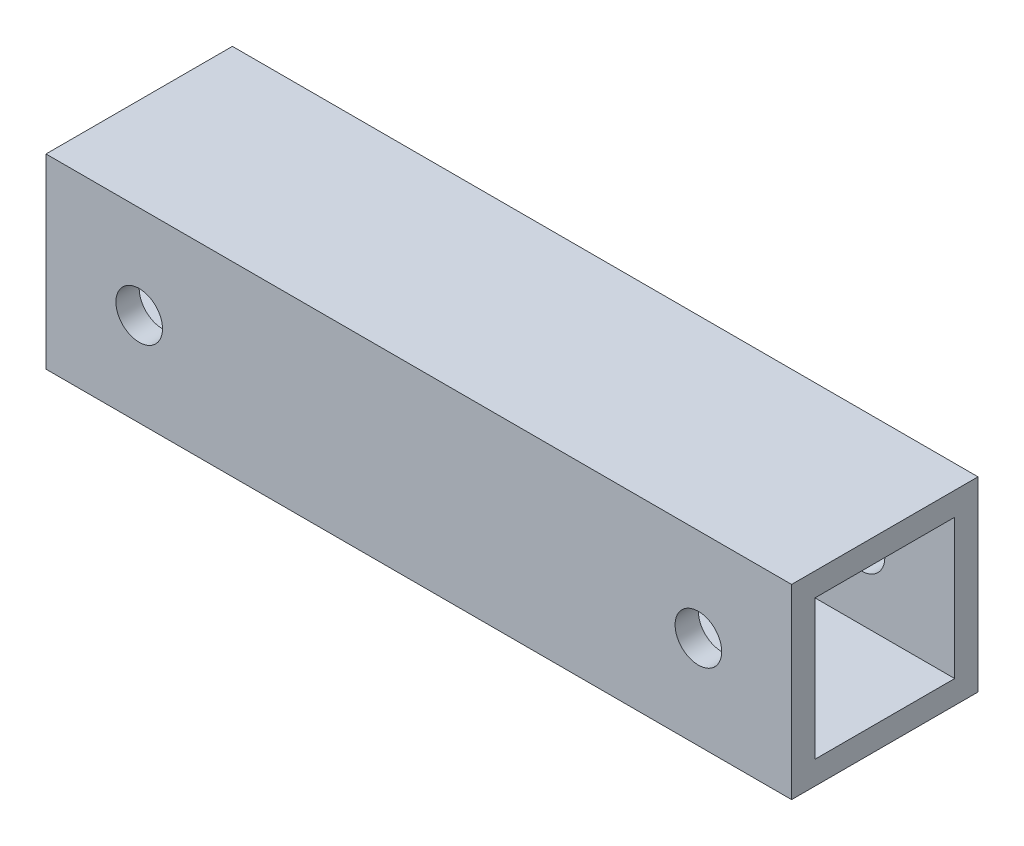
ISO-10303-21;
HEADER;
FILE_DESCRIPTION(('STEP AP214'),'2;1');
FILE_NAME('part.step','',(''),(''),'','','');
FILE_SCHEMA(('AUTOMOTIVE_DESIGN { 1 0 10303 214 1 1 1 1 }'));
ENDSEC;
DATA;
#1=APPLICATION_CONTEXT('core data for automotive mechanical design processes');
#2=APPLICATION_PROTOCOL_DEFINITION('international standard','automotive_design',2000,#1);
#3=PRODUCT_CONTEXT('',#1,'mechanical');
#4=PRODUCT('Part','Part','',(#3));
#5=PRODUCT_RELATED_PRODUCT_CATEGORY('part','',(#4));
#6=PRODUCT_DEFINITION_FORMATION('','',#4);
#7=PRODUCT_DEFINITION_CONTEXT('part definition',#1,'design');
#8=PRODUCT_DEFINITION('design','',#6,#7);
#9=PRODUCT_DEFINITION_SHAPE('','',#8);
#10=(LENGTH_UNIT() NAMED_UNIT(*) SI_UNIT(.MILLI.,.METRE.));
#11=(NAMED_UNIT(*) PLANE_ANGLE_UNIT() SI_UNIT($,.RADIAN.));
#12=(NAMED_UNIT(*) SI_UNIT($,.STERADIAN.) SOLID_ANGLE_UNIT());
#13=UNCERTAINTY_MEASURE_WITH_UNIT(LENGTH_MEASURE(1.E-05),#10,'distance_accuracy_value','');
#14=(GEOMETRIC_REPRESENTATION_CONTEXT(3) GLOBAL_UNCERTAINTY_ASSIGNED_CONTEXT((#13)) GLOBAL_UNIT_ASSIGNED_CONTEXT((#10,
#11,#12)) REPRESENTATION_CONTEXT('',''));
#15=CARTESIAN_POINT('',(0.,0.,0.));
#16=DIRECTION('',(0.,0.,1.));
#17=DIRECTION('',(1.,0.,0.));
#18=AXIS2_PLACEMENT_3D('',#15,#16,#17);
#19=CARTESIAN_POINT('',(50.8,-12.7,25.4));
#20=DIRECTION('',(-1.,0.,0.));
#21=DIRECTION('',(0.,0.,1.));
#22=AXIS2_PLACEMENT_3D('',#19,#20,#21);
#23=PLANE('',#22);
#24=DIRECTION('',(0.,1.,0.));
#25=VECTOR('',#24,1.);
#26=CARTESIAN_POINT('',(50.8,-12.7,0.));
#27=LINE('',#26,#25);
#28=CARTESIAN_POINT('',(50.8,-12.7,0.));
#29=VERTEX_POINT('',#28);
#30=CARTESIAN_POINT('',(50.8,12.7,0.));
#31=VERTEX_POINT('',#30);
#32=EDGE_CURVE('E122',#29,#31,#27,.T.);
#33=ORIENTED_EDGE('',*,*,#32,.T.);
#34=DIRECTION('',(0.,0.,-1.));
#35=VECTOR('',#34,1.);
#36=CARTESIAN_POINT('',(50.8,12.7,25.4));
#37=LINE('',#36,#35);
#38=CARTESIAN_POINT('',(50.8,12.7,25.4));
#39=VERTEX_POINT('',#38);
#40=EDGE_CURVE('E151',#39,#31,#37,.T.);
#41=ORIENTED_EDGE('',*,*,#40,.F.);
#42=DIRECTION('',(0.,1.,0.));
#43=VECTOR('',#42,1.);
#44=CARTESIAN_POINT('',(50.8,-12.7,25.4));
#45=LINE('',#44,#43);
#46=CARTESIAN_POINT('',(50.8,-12.7,25.4));
#47=VERTEX_POINT('',#46);
#48=EDGE_CURVE('E125',#47,#39,#45,.T.);
#49=ORIENTED_EDGE('',*,*,#48,.F.);
#50=DIRECTION('',(0.,0.,-1.));
#51=VECTOR('',#50,1.);
#52=CARTESIAN_POINT('',(50.8,-12.7,25.4));
#53=LINE('',#52,#51);
#54=EDGE_CURVE('E135',#47,#29,#53,.T.);
#55=ORIENTED_EDGE('',*,*,#54,.T.);
#56=EDGE_LOOP('',(#33,#41,#49,#55));
#57=FACE_BOUND('',#56,.T.);
#58=DIRECTION('',(0.,0.,-1.));
#59=VECTOR('',#58,1.);
#60=CARTESIAN_POINT('',(50.8,9.52035864154581,0.));
#61=LINE('',#60,#59);
#62=CARTESIAN_POINT('',(50.8,9.52035864154581,22.225));
#63=VERTEX_POINT('',#62);
#64=CARTESIAN_POINT('',(50.8,9.52035864154581,3.175));
#65=VERTEX_POINT('',#64);
#66=EDGE_CURVE('E49',#63,#65,#61,.T.);
#67=ORIENTED_EDGE('',*,*,#66,.T.);
#68=DIRECTION('',(0.,1.,0.));
#69=VECTOR('',#68,1.);
#70=CARTESIAN_POINT('',(50.8,0.,3.175));
#71=LINE('',#70,#69);
#72=CARTESIAN_POINT('',(50.8,-9.52035864154582,3.175));
#73=VERTEX_POINT('',#72);
#74=EDGE_CURVE('E115',#73,#65,#71,.T.);
#75=ORIENTED_EDGE('',*,*,#74,.F.);
#76=DIRECTION('',(0.,0.,-1.));
#77=VECTOR('',#76,1.);
#78=CARTESIAN_POINT('',(50.8,-9.52035864154582,0.));
#79=LINE('',#78,#77);
#80=CARTESIAN_POINT('',(50.8,-9.52035864154582,22.225));
#81=VERTEX_POINT('',#80);
#82=EDGE_CURVE('E101',#81,#73,#79,.T.);
#83=ORIENTED_EDGE('',*,*,#82,.F.);
#84=DIRECTION('',(0.,1.,0.));
#85=VECTOR('',#84,1.);
#86=CARTESIAN_POINT('',(50.8,0.,22.225));
#87=LINE('',#86,#85);
#88=EDGE_CURVE('E110',#81,#63,#87,.T.);
#89=ORIENTED_EDGE('',*,*,#88,.T.);
#90=EDGE_LOOP('',(#67,#75,#83,#89));
#91=FACE_BOUND('',#90,.T.);
#92=ADVANCED_FACE('F33',(#57,#91),#23,.F.);
#93=CARTESIAN_POINT('',(-50.8,-12.7,25.4));
#94=DIRECTION('',(1.,0.,0.));
#95=DIRECTION('',(0.,0.,-1.));
#96=AXIS2_PLACEMENT_3D('',#93,#94,#95);
#97=PLANE('',#96);
#98=DIRECTION('',(0.,-1.,0.));
#99=VECTOR('',#98,1.);
#100=CARTESIAN_POINT('',(-50.8,-12.7,0.));
#101=LINE('',#100,#99);
#102=CARTESIAN_POINT('',(-50.8,12.7,0.));
#103=VERTEX_POINT('',#102);
#104=CARTESIAN_POINT('',(-50.8,-12.7,0.));
#105=VERTEX_POINT('',#104);
#106=EDGE_CURVE('E140',#103,#105,#101,.T.);
#107=ORIENTED_EDGE('',*,*,#106,.T.);
#108=DIRECTION('',(0.,0.,-1.));
#109=VECTOR('',#108,1.);
#110=CARTESIAN_POINT('',(-50.8,-12.7,25.4));
#111=LINE('',#110,#109);
#112=CARTESIAN_POINT('',(-50.8,-12.7,25.4));
#113=VERTEX_POINT('',#112);
#114=EDGE_CURVE('E145',#113,#105,#111,.T.);
#115=ORIENTED_EDGE('',*,*,#114,.F.);
#116=DIRECTION('',(0.,-1.,0.));
#117=VECTOR('',#116,1.);
#118=CARTESIAN_POINT('',(-50.8,-12.7,25.4));
#119=LINE('',#118,#117);
#120=CARTESIAN_POINT('',(-50.8,12.7,25.4));
#121=VERTEX_POINT('',#120);
#122=EDGE_CURVE('E131',#121,#113,#119,.T.);
#123=ORIENTED_EDGE('',*,*,#122,.F.);
#124=DIRECTION('',(0.,0.,-1.));
#125=VECTOR('',#124,1.);
#126=CARTESIAN_POINT('',(-50.8,12.7,25.4));
#127=LINE('',#126,#125);
#128=EDGE_CURVE('E148',#121,#103,#127,.T.);
#129=ORIENTED_EDGE('',*,*,#128,.T.);
#130=EDGE_LOOP('',(#107,#115,#123,#129));
#131=FACE_BOUND('',#130,.T.);
#132=DIRECTION('',(0.,0.,-1.));
#133=VECTOR('',#132,1.);
#134=CARTESIAN_POINT('',(-50.8,9.52035864154581,25.4));
#135=LINE('',#134,#133);
#136=CARTESIAN_POINT('',(-50.8,9.52035864154581,22.225));
#137=VERTEX_POINT('',#136);
#138=CARTESIAN_POINT('',(-50.8,9.52035864154581,3.175));
#139=VERTEX_POINT('',#138);
#140=EDGE_CURVE('E11',#137,#139,#135,.T.);
#141=ORIENTED_EDGE('',*,*,#140,.F.);
#142=DIRECTION('',(0.,1.,0.));
#143=VECTOR('',#142,1.);
#144=CARTESIAN_POINT('',(-50.8,-12.7,22.225));
#145=LINE('',#144,#143);
#146=CARTESIAN_POINT('',(-50.8,-9.52035864154582,22.225));
#147=VERTEX_POINT('',#146);
#148=EDGE_CURVE('E154',#147,#137,#145,.T.);
#149=ORIENTED_EDGE('',*,*,#148,.F.);
#150=DIRECTION('',(0.,0.,-1.));
#151=VECTOR('',#150,1.);
#152=CARTESIAN_POINT('',(-50.8,-9.52035864154582,25.4));
#153=LINE('',#152,#151);
#154=CARTESIAN_POINT('',(-50.8,-9.52035864154582,3.175));
#155=VERTEX_POINT('',#154);
#156=EDGE_CURVE('E104',#147,#155,#153,.T.);
#157=ORIENTED_EDGE('',*,*,#156,.T.);
#158=DIRECTION('',(0.,1.,0.));
#159=VECTOR('',#158,1.);
#160=CARTESIAN_POINT('',(-50.8,-12.7,3.175));
#161=LINE('',#160,#159);
#162=EDGE_CURVE('E41',#155,#139,#161,.T.);
#163=ORIENTED_EDGE('',*,*,#162,.T.);
#164=EDGE_LOOP('',(#141,#149,#157,#163));
#165=FACE_BOUND('',#164,.T.);
#166=ADVANCED_FACE('F208',(#131,#165),#97,.F.);
#167=CARTESIAN_POINT('',(-50.8,12.7,25.4));
#168=DIRECTION('',(0.,-1.,0.));
#169=DIRECTION('',(0.,0.,-1.));
#170=AXIS2_PLACEMENT_3D('',#167,#168,#169);
#171=PLANE('',#170);
#172=DIRECTION('',(-1.,0.,0.));
#173=VECTOR('',#172,1.);
#174=CARTESIAN_POINT('',(-50.8,12.7,0.));
#175=LINE('',#174,#173);
#176=EDGE_CURVE('E138',#31,#103,#175,.T.);
#177=ORIENTED_EDGE('',*,*,#176,.T.);
#178=ORIENTED_EDGE('',*,*,#128,.F.);
#179=DIRECTION('',(-1.,0.,0.));
#180=VECTOR('',#179,1.);
#181=CARTESIAN_POINT('',(-50.8,12.7,25.4));
#182=LINE('',#181,#180);
#183=EDGE_CURVE('E128',#39,#121,#182,.T.);
#184=ORIENTED_EDGE('',*,*,#183,.F.);
#185=ORIENTED_EDGE('',*,*,#40,.T.);
#186=EDGE_LOOP('',(#177,#178,#184,#185));
#187=FACE_BOUND('',#186,.T.);
#188=ADVANCED_FACE('F212',(#187),#171,.F.);
#189=CARTESIAN_POINT('',(-50.8,-12.7,25.4));
#190=DIRECTION('',(0.,1.,0.));
#191=DIRECTION('',(0.,0.,1.));
#192=AXIS2_PLACEMENT_3D('',#189,#190,#191);
#193=PLANE('',#192);
#194=DIRECTION('',(1.,0.,0.));
#195=VECTOR('',#194,1.);
#196=CARTESIAN_POINT('',(-50.8,-12.7,0.));
#197=LINE('',#196,#195);
#198=EDGE_CURVE('E129',#105,#29,#197,.T.);
#199=ORIENTED_EDGE('',*,*,#198,.T.);
#200=ORIENTED_EDGE('',*,*,#54,.F.);
#201=DIRECTION('',(1.,0.,0.));
#202=VECTOR('',#201,1.);
#203=CARTESIAN_POINT('',(-50.8,-12.7,25.4));
#204=LINE('',#203,#202);
#205=EDGE_CURVE('E133',#113,#47,#204,.T.);
#206=ORIENTED_EDGE('',*,*,#205,.F.);
#207=ORIENTED_EDGE('',*,*,#114,.T.);
#208=EDGE_LOOP('',(#199,#200,#206,#207));
#209=FACE_BOUND('',#208,.T.);
#210=ADVANCED_FACE('F204',(#209),#193,.F.);
#211=CARTESIAN_POINT('',(0.,0.,25.4));
#212=DIRECTION('',(0.,0.,-1.));
#213=DIRECTION('',(-1.,0.,0.));
#214=AXIS2_PLACEMENT_3D('',#211,#212,#213);
#215=PLANE('',#214);
#216=CARTESIAN_POINT('',(-38.1,0.,25.4));
#217=DIRECTION('',(0.,0.,1.));
#218=DIRECTION('',(1.,0.,0.));
#219=AXIS2_PLACEMENT_3D('',#216,#217,#218);
#220=CIRCLE('',#219,3.175);
#221=CARTESIAN_POINT('',(-34.925,0.,25.4));
#222=VERTEX_POINT('',#221);
#223=EDGE_CURVE('E161',#222,#222,#220,.T.);
#224=ORIENTED_EDGE('',*,*,#223,.F.);
#225=EDGE_LOOP('',(#224));
#226=FACE_BOUND('',#225,.T.);
#227=CARTESIAN_POINT('',(38.1,0.,25.4));
#228=DIRECTION('',(0.,0.,1.));
#229=DIRECTION('',(1.,0.,0.));
#230=AXIS2_PLACEMENT_3D('',#227,#228,#229);
#231=CIRCLE('',#230,3.175);
#232=CARTESIAN_POINT('',(41.275,0.,25.4));
#233=VERTEX_POINT('',#232);
#234=EDGE_CURVE('E168',#233,#233,#231,.T.);
#235=ORIENTED_EDGE('',*,*,#234,.F.);
#236=EDGE_LOOP('',(#235));
#237=FACE_BOUND('',#236,.T.);
#238=ORIENTED_EDGE('',*,*,#48,.T.);
#239=ORIENTED_EDGE('',*,*,#183,.T.);
#240=ORIENTED_EDGE('',*,*,#122,.T.);
#241=ORIENTED_EDGE('',*,*,#205,.T.);
#242=EDGE_LOOP('',(#238,#239,#240,#241));
#243=FACE_BOUND('',#242,.T.);
#244=ADVANCED_FACE('F191',(#226,#237,#243),#215,.F.);
#245=CARTESIAN_POINT('',(0.,0.,0.));
#246=DIRECTION('',(0.,0.,-1.));
#247=DIRECTION('',(-1.,0.,0.));
#248=AXIS2_PLACEMENT_3D('',#245,#246,#247);
#249=PLANE('',#248);
#250=CARTESIAN_POINT('',(-38.1,0.,0.));
#251=DIRECTION('',(0.,0.,-1.));
#252=DIRECTION('',(-1.,0.,0.));
#253=AXIS2_PLACEMENT_3D('',#250,#251,#252);
#254=CIRCLE('',#253,3.175);
#255=CARTESIAN_POINT('',(-41.275,0.,0.));
#256=VERTEX_POINT('',#255);
#257=EDGE_CURVE('E180',#256,#256,#254,.T.);
#258=ORIENTED_EDGE('',*,*,#257,.F.);
#259=EDGE_LOOP('',(#258));
#260=FACE_BOUND('',#259,.T.);
#261=CARTESIAN_POINT('',(38.1,0.,0.));
#262=DIRECTION('',(0.,0.,-1.));
#263=DIRECTION('',(-1.,0.,0.));
#264=AXIS2_PLACEMENT_3D('',#261,#262,#263);
#265=CIRCLE('',#264,3.175);
#266=CARTESIAN_POINT('',(34.925,0.,0.));
#267=VERTEX_POINT('',#266);
#268=EDGE_CURVE('E165',#267,#267,#265,.T.);
#269=ORIENTED_EDGE('',*,*,#268,.F.);
#270=EDGE_LOOP('',(#269));
#271=FACE_BOUND('',#270,.T.);
#272=ORIENTED_EDGE('',*,*,#32,.F.);
#273=ORIENTED_EDGE('',*,*,#198,.F.);
#274=ORIENTED_EDGE('',*,*,#106,.F.);
#275=ORIENTED_EDGE('',*,*,#176,.F.);
#276=EDGE_LOOP('',(#272,#273,#274,#275));
#277=FACE_BOUND('',#276,.T.);
#278=ADVANCED_FACE('F187',(#260,#271,#277),#249,.T.);
#279=CARTESIAN_POINT('',(-457.2,9.52035864154581,0.));
#280=DIRECTION('',(0.,-1.,0.));
#281=DIRECTION('',(0.,0.,-1.));
#282=AXIS2_PLACEMENT_3D('',#279,#280,#281);
#283=PLANE('',#282);
#284=ORIENTED_EDGE('',*,*,#140,.T.);
#285=DIRECTION('',(1.,0.,0.));
#286=VECTOR('',#285,1.);
#287=CARTESIAN_POINT('',(-457.2,9.52035864154581,3.175));
#288=LINE('',#287,#286);
#289=EDGE_CURVE('E120',#139,#65,#288,.T.);
#290=ORIENTED_EDGE('',*,*,#289,.T.);
#291=ORIENTED_EDGE('',*,*,#66,.F.);
#292=DIRECTION('',(1.,0.,0.));
#293=VECTOR('',#292,1.);
#294=CARTESIAN_POINT('',(-457.2,9.52035864154581,22.225));
#295=LINE('',#294,#293);
#296=EDGE_CURVE('E107',#137,#63,#295,.T.);
#297=ORIENTED_EDGE('',*,*,#296,.F.);
#298=EDGE_LOOP('',(#284,#290,#291,#297));
#299=FACE_BOUND('',#298,.T.);
#300=ADVANCED_FACE('F190',(#299),#283,.T.);
#301=CARTESIAN_POINT('',(-457.2,0.,3.175));
#302=DIRECTION('',(0.,0.,-1.));
#303=DIRECTION('',(-1.,0.,0.));
#304=AXIS2_PLACEMENT_3D('',#301,#302,#303);
#305=PLANE('',#304);
#306=CARTESIAN_POINT('',(-38.1,0.,3.17499999999998));
#307=DIRECTION('',(0.,0.,-1.));
#308=DIRECTION('',(-1.,0.,0.));
#309=AXIS2_PLACEMENT_3D('',#306,#307,#308);
#310=CIRCLE('',#309,3.175);
#311=CARTESIAN_POINT('',(-41.275,0.,3.17499999999998));
#312=VERTEX_POINT('',#311);
#313=EDGE_CURVE('E177',#312,#312,#310,.T.);
#314=ORIENTED_EDGE('',*,*,#313,.T.);
#315=EDGE_LOOP('',(#314));
#316=FACE_BOUND('',#315,.T.);
#317=CARTESIAN_POINT('',(38.1,0.,3.17499999999998));
#318=DIRECTION('',(0.,0.,-1.));
#319=DIRECTION('',(-1.,0.,0.));
#320=AXIS2_PLACEMENT_3D('',#317,#318,#319);
#321=CIRCLE('',#320,3.175);
#322=CARTESIAN_POINT('',(34.925,0.,3.17499999999998));
#323=VERTEX_POINT('',#322);
#324=EDGE_CURVE('E160',#323,#323,#321,.T.);
#325=ORIENTED_EDGE('',*,*,#324,.T.);
#326=EDGE_LOOP('',(#325));
#327=FACE_BOUND('',#326,.T.);
#328=DIRECTION('',(1.,0.,0.));
#329=VECTOR('',#328,1.);
#330=CARTESIAN_POINT('',(-457.2,-9.52035864154582,3.175));
#331=LINE('',#330,#329);
#332=EDGE_CURVE('E106',#155,#73,#331,.T.);
#333=ORIENTED_EDGE('',*,*,#332,.T.);
#334=ORIENTED_EDGE('',*,*,#74,.T.);
#335=ORIENTED_EDGE('',*,*,#289,.F.);
#336=ORIENTED_EDGE('',*,*,#162,.F.);
#337=EDGE_LOOP('',(#333,#334,#335,#336));
#338=FACE_BOUND('',#337,.T.);
#339=ADVANCED_FACE('F256',(#316,#327,#338),#305,.F.);
#340=CARTESIAN_POINT('',(-457.2,-9.52035864154582,0.));
#341=DIRECTION('',(0.,-1.,0.));
#342=DIRECTION('',(0.,0.,-1.));
#343=AXIS2_PLACEMENT_3D('',#340,#341,#342);
#344=PLANE('',#343);
#345=DIRECTION('',(1.,0.,0.));
#346=VECTOR('',#345,1.);
#347=CARTESIAN_POINT('',(-457.2,-9.52035864154582,22.225));
#348=LINE('',#347,#346);
#349=EDGE_CURVE('E57',#147,#81,#348,.T.);
#350=ORIENTED_EDGE('',*,*,#349,.T.);
#351=ORIENTED_EDGE('',*,*,#82,.T.);
#352=ORIENTED_EDGE('',*,*,#332,.F.);
#353=ORIENTED_EDGE('',*,*,#156,.F.);
#354=EDGE_LOOP('',(#350,#351,#352,#353));
#355=FACE_BOUND('',#354,.T.);
#356=ADVANCED_FACE('F98',(#355),#344,.F.);
#357=CARTESIAN_POINT('',(-457.2,0.,22.225));
#358=DIRECTION('',(0.,0.,-1.));
#359=DIRECTION('',(0.,1.,0.));
#360=AXIS2_PLACEMENT_3D('',#357,#358,#359);
#361=PLANE('',#360);
#362=CARTESIAN_POINT('',(-38.1,0.,22.2250000000001));
#363=DIRECTION('',(0.,0.,-1.));
#364=DIRECTION('',(0.,1.,0.));
#365=AXIS2_PLACEMENT_3D('',#362,#363,#364);
#366=CIRCLE('',#365,3.175);
#367=CARTESIAN_POINT('',(-38.1,3.175,22.2250000000001));
#368=VERTEX_POINT('',#367);
#369=EDGE_CURVE('E36',#368,#368,#366,.T.);
#370=ORIENTED_EDGE('',*,*,#369,.F.);
#371=EDGE_LOOP('',(#370));
#372=FACE_BOUND('',#371,.T.);
#373=CARTESIAN_POINT('',(38.1,0.,22.2250000000001));
#374=DIRECTION('',(0.,0.,-1.));
#375=DIRECTION('',(0.,1.,0.));
#376=AXIS2_PLACEMENT_3D('',#373,#374,#375);
#377=CIRCLE('',#376,3.175);
#378=CARTESIAN_POINT('',(38.1,3.175,22.2250000000001));
#379=VERTEX_POINT('',#378);
#380=EDGE_CURVE('E158',#379,#379,#377,.T.);
#381=ORIENTED_EDGE('',*,*,#380,.F.);
#382=EDGE_LOOP('',(#381));
#383=FACE_BOUND('',#382,.T.);
#384=ORIENTED_EDGE('',*,*,#148,.T.);
#385=ORIENTED_EDGE('',*,*,#296,.T.);
#386=ORIENTED_EDGE('',*,*,#88,.F.);
#387=ORIENTED_EDGE('',*,*,#349,.F.);
#388=EDGE_LOOP('',(#384,#385,#386,#387));
#389=FACE_BOUND('',#388,.T.);
#390=ADVANCED_FACE('F111',(#372,#383,#389),#361,.T.);
#391=CARTESIAN_POINT('',(38.1,0.,-482.6));
#392=DIRECTION('',(0.,0.,1.));
#393=DIRECTION('',(1.,0.,0.));
#394=AXIS2_PLACEMENT_3D('',#391,#392,#393);
#395=CYLINDRICAL_SURFACE('',#394,3.175);
#396=ORIENTED_EDGE('',*,*,#380,.T.);
#397=EDGE_LOOP('',(#396));
#398=FACE_BOUND('',#397,.T.);
#399=ORIENTED_EDGE('',*,*,#234,.T.);
#400=EDGE_LOOP('',(#399));
#401=FACE_BOUND('',#400,.T.);
#402=ADVANCED_FACE('F289',(#398,#401),#395,.F.);
#403=CARTESIAN_POINT('',(-38.1,0.,-482.6));
#404=DIRECTION('',(0.,0.,1.));
#405=DIRECTION('',(1.,0.,0.));
#406=AXIS2_PLACEMENT_3D('',#403,#404,#405);
#407=CYLINDRICAL_SURFACE('',#406,3.175);
#408=ORIENTED_EDGE('',*,*,#369,.T.);
#409=EDGE_LOOP('',(#408));
#410=FACE_BOUND('',#409,.T.);
#411=ORIENTED_EDGE('',*,*,#223,.T.);
#412=EDGE_LOOP('',(#411));
#413=FACE_BOUND('',#412,.T.);
#414=ADVANCED_FACE('F299',(#410,#413),#407,.F.);
#415=ORIENTED_EDGE('',*,*,#268,.T.);
#416=EDGE_LOOP('',(#415));
#417=FACE_BOUND('',#416,.T.);
#418=ORIENTED_EDGE('',*,*,#324,.F.);
#419=EDGE_LOOP('',(#418));
#420=FACE_BOUND('',#419,.T.);
#421=ADVANCED_FACE('F301',(#417,#420),#395,.F.);
#422=ORIENTED_EDGE('',*,*,#257,.T.);
#423=EDGE_LOOP('',(#422));
#424=FACE_BOUND('',#423,.T.);
#425=ORIENTED_EDGE('',*,*,#313,.F.);
#426=EDGE_LOOP('',(#425));
#427=FACE_BOUND('',#426,.T.);
#428=ADVANCED_FACE('F184',(#424,#427),#407,.F.);
#429=CLOSED_SHELL('',(#92,#166,#188,#210,#244,#278,#300,#339,#356,#390,#402,#414,#421,#428));
#430=MANIFOLD_SOLID_BREP('B2',#429);
#431=ADVANCED_BREP_SHAPE_REPRESENTATION('',(#18,#430),#14);
#432=SHAPE_DEFINITION_REPRESENTATION(#9,#431);
ENDSEC;
END-ISO-10303-21;
